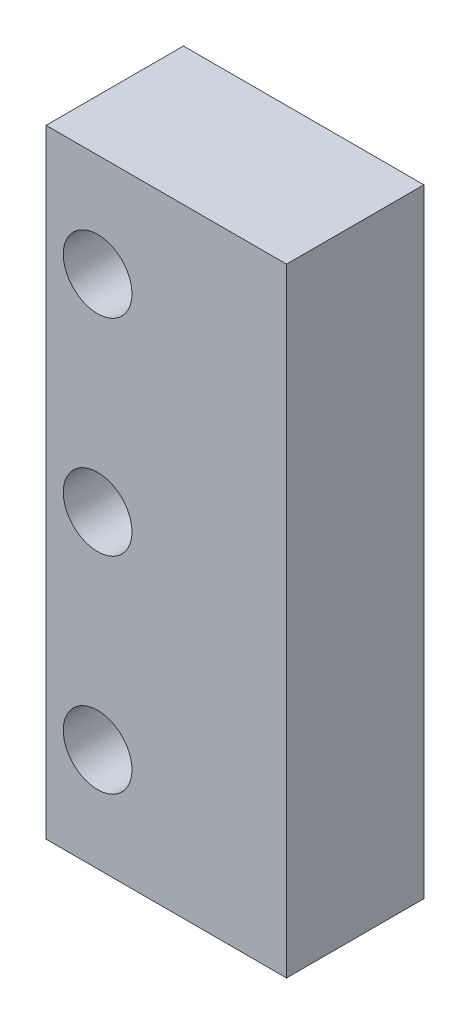
ISO-10303-21;
HEADER;
FILE_DESCRIPTION(('STEP AP214'),'2;1');
FILE_NAME('part.step','',(''),(''),'','','');
FILE_SCHEMA(('AUTOMOTIVE_DESIGN { 1 0 10303 214 1 1 1 1 }'));
ENDSEC;
DATA;
#1=APPLICATION_CONTEXT('core data for automotive mechanical design processes');
#2=APPLICATION_PROTOCOL_DEFINITION('international standard','automotive_design',2000,#1);
#3=PRODUCT_CONTEXT('',#1,'mechanical');
#4=PRODUCT('Part','Part','',(#3));
#5=PRODUCT_RELATED_PRODUCT_CATEGORY('part','',(#4));
#6=PRODUCT_DEFINITION_FORMATION('','',#4);
#7=PRODUCT_DEFINITION_CONTEXT('part definition',#1,'design');
#8=PRODUCT_DEFINITION('design','',#6,#7);
#9=PRODUCT_DEFINITION_SHAPE('','',#8);
#10=(LENGTH_UNIT() NAMED_UNIT(*) SI_UNIT(.MILLI.,.METRE.));
#11=(NAMED_UNIT(*) PLANE_ANGLE_UNIT() SI_UNIT($,.RADIAN.));
#12=(NAMED_UNIT(*) SI_UNIT($,.STERADIAN.) SOLID_ANGLE_UNIT());
#13=UNCERTAINTY_MEASURE_WITH_UNIT(LENGTH_MEASURE(1.E-05),#10,'distance_accuracy_value','');
#14=(GEOMETRIC_REPRESENTATION_CONTEXT(3) GLOBAL_UNCERTAINTY_ASSIGNED_CONTEXT((#13)) GLOBAL_UNIT_ASSIGNED_CONTEXT((#10,
#11,#12)) REPRESENTATION_CONTEXT('',''));
#15=CARTESIAN_POINT('',(0.,0.,0.));
#16=DIRECTION('',(0.,0.,1.));
#17=DIRECTION('',(1.,0.,0.));
#18=AXIS2_PLACEMENT_3D('',#15,#16,#17);
#19=CARTESIAN_POINT('',(0.,0.,-12.7));
#20=DIRECTION('',(1.,0.,0.));
#21=DIRECTION('',(0.,0.,-1.));
#22=AXIS2_PLACEMENT_3D('',#19,#20,#21);
#23=PLANE('',#22);
#24=DIRECTION('',(0.,1.,0.));
#25=VECTOR('',#24,1.);
#26=CARTESIAN_POINT('',(0.,0.,0.));
#27=LINE('',#26,#25);
#28=CARTESIAN_POINT('',(0.,0.,0.));
#29=VERTEX_POINT('',#28);
#30=CARTESIAN_POINT('',(0.,57.15,0.));
#31=VERTEX_POINT('',#30);
#32=EDGE_CURVE('E121',#29,#31,#27,.T.);
#33=ORIENTED_EDGE('',*,*,#32,.F.);
#34=DIRECTION('',(0.,0.,1.));
#35=VECTOR('',#34,1.);
#36=CARTESIAN_POINT('',(0.,0.,-12.7));
#37=LINE('',#36,#35);
#38=CARTESIAN_POINT('',(0.,0.,-12.7));
#39=VERTEX_POINT('',#38);
#40=EDGE_CURVE('E11',#39,#29,#37,.T.);
#41=ORIENTED_EDGE('',*,*,#40,.F.);
#42=DIRECTION('',(0.,1.,0.));
#43=VECTOR('',#42,1.);
#44=CARTESIAN_POINT('',(0.,0.,-12.7));
#45=LINE('',#44,#43);
#46=CARTESIAN_POINT('',(0.,57.15,-12.7));
#47=VERTEX_POINT('',#46);
#48=EDGE_CURVE('E112',#39,#47,#45,.T.);
#49=ORIENTED_EDGE('',*,*,#48,.T.);
#50=DIRECTION('',(0.,0.,1.));
#51=VECTOR('',#50,1.);
#52=CARTESIAN_POINT('',(0.,57.15,-12.7));
#53=LINE('',#52,#51);
#54=EDGE_CURVE('E50',#47,#31,#53,.T.);
#55=ORIENTED_EDGE('',*,*,#54,.T.);
#56=EDGE_LOOP('',(#33,#41,#49,#55));
#57=FACE_BOUND('',#56,.T.);
#58=ADVANCED_FACE('F47',(#57),#23,.T.);
#59=CARTESIAN_POINT('',(0.,0.,-12.7));
#60=DIRECTION('',(0.,-1.,0.));
#61=DIRECTION('',(1.,0.,0.));
#62=AXIS2_PLACEMENT_3D('',#59,#60,#61);
#63=PLANE('',#62);
#64=DIRECTION('',(1.,0.,0.));
#65=VECTOR('',#64,1.);
#66=CARTESIAN_POINT('',(0.,0.,0.));
#67=LINE('',#66,#65);
#68=CARTESIAN_POINT('',(-22.225,0.,0.));
#69=VERTEX_POINT('',#68);
#70=EDGE_CURVE('E116',#69,#29,#67,.T.);
#71=ORIENTED_EDGE('',*,*,#70,.F.);
#72=DIRECTION('',(0.,0.,1.));
#73=VECTOR('',#72,1.);
#74=CARTESIAN_POINT('',(-22.225,0.,-12.7));
#75=LINE('',#74,#73);
#76=CARTESIAN_POINT('',(-22.225,0.,-12.7));
#77=VERTEX_POINT('',#76);
#78=EDGE_CURVE('E56',#77,#69,#75,.T.);
#79=ORIENTED_EDGE('',*,*,#78,.F.);
#80=DIRECTION('',(1.,0.,0.));
#81=VECTOR('',#80,1.);
#82=CARTESIAN_POINT('',(0.,0.,-12.7));
#83=LINE('',#82,#81);
#84=EDGE_CURVE('E107',#77,#39,#83,.T.);
#85=ORIENTED_EDGE('',*,*,#84,.T.);
#86=ORIENTED_EDGE('',*,*,#40,.T.);
#87=EDGE_LOOP('',(#71,#79,#85,#86));
#88=FACE_BOUND('',#87,.T.);
#89=ADVANCED_FACE('F135',(#88),#63,.T.);
#90=CARTESIAN_POINT('',(-22.225,0.,-12.7));
#91=DIRECTION('',(-1.,0.,0.));
#92=DIRECTION('',(0.,0.,1.));
#93=AXIS2_PLACEMENT_3D('',#90,#91,#92);
#94=PLANE('',#93);
#95=DIRECTION('',(0.,-1.,0.));
#96=VECTOR('',#95,1.);
#97=CARTESIAN_POINT('',(-22.225,0.,0.));
#98=LINE('',#97,#96);
#99=CARTESIAN_POINT('',(-22.225,57.15,0.));
#100=VERTEX_POINT('',#99);
#101=EDGE_CURVE('E101',#100,#69,#98,.T.);
#102=ORIENTED_EDGE('',*,*,#101,.F.);
#103=DIRECTION('',(0.,0.,1.));
#104=VECTOR('',#103,1.);
#105=CARTESIAN_POINT('',(-22.225,57.15,-12.7));
#106=LINE('',#105,#104);
#107=CARTESIAN_POINT('',(-22.225,57.15,-12.7));
#108=VERTEX_POINT('',#107);
#109=EDGE_CURVE('E96',#108,#100,#106,.T.);
#110=ORIENTED_EDGE('',*,*,#109,.F.);
#111=DIRECTION('',(0.,-1.,0.));
#112=VECTOR('',#111,1.);
#113=CARTESIAN_POINT('',(-22.225,0.,-12.7));
#114=LINE('',#113,#112);
#115=EDGE_CURVE('E99',#108,#77,#114,.T.);
#116=ORIENTED_EDGE('',*,*,#115,.T.);
#117=ORIENTED_EDGE('',*,*,#78,.T.);
#118=EDGE_LOOP('',(#102,#110,#116,#117));
#119=FACE_BOUND('',#118,.T.);
#120=ADVANCED_FACE('F98',(#119),#94,.T.);
#121=CARTESIAN_POINT('',(0.,57.15,-12.7));
#122=DIRECTION('',(0.,1.,0.));
#123=DIRECTION('',(0.,0.,1.));
#124=AXIS2_PLACEMENT_3D('',#121,#122,#123);
#125=PLANE('',#124);
#126=DIRECTION('',(-1.,0.,0.));
#127=VECTOR('',#126,1.);
#128=CARTESIAN_POINT('',(0.,57.15,0.));
#129=LINE('',#128,#127);
#130=EDGE_CURVE('E125',#31,#100,#129,.T.);
#131=ORIENTED_EDGE('',*,*,#130,.F.);
#132=ORIENTED_EDGE('',*,*,#54,.F.);
#133=DIRECTION('',(-1.,0.,0.));
#134=VECTOR('',#133,1.);
#135=CARTESIAN_POINT('',(0.,57.15,-12.7));
#136=LINE('',#135,#134);
#137=EDGE_CURVE('E106',#47,#108,#136,.T.);
#138=ORIENTED_EDGE('',*,*,#137,.T.);
#139=ORIENTED_EDGE('',*,*,#109,.T.);
#140=EDGE_LOOP('',(#131,#132,#138,#139));
#141=FACE_BOUND('',#140,.T.);
#142=ADVANCED_FACE('F110',(#141),#125,.T.);
#143=CARTESIAN_POINT('',(0.,0.,-12.7));
#144=DIRECTION('',(0.,0.,1.));
#145=DIRECTION('',(1.,0.,0.));
#146=AXIS2_PLACEMENT_3D('',#143,#144,#145);
#147=PLANE('',#146);
#148=CARTESIAN_POINT('',(-17.4625,47.625,-12.7));
#149=DIRECTION('',(0.,0.,1.));
#150=DIRECTION('',(1.,0.,0.));
#151=AXIS2_PLACEMENT_3D('',#148,#149,#150);
#152=CIRCLE('',#151,3.175);
#153=CARTESIAN_POINT('',(-14.2875,47.625,-12.7));
#154=VERTEX_POINT('',#153);
#155=EDGE_CURVE('E170',#154,#154,#152,.T.);
#156=ORIENTED_EDGE('',*,*,#155,.T.);
#157=EDGE_LOOP('',(#156));
#158=FACE_BOUND('',#157,.T.);
#159=CARTESIAN_POINT('',(-17.4625,28.575,-12.7));
#160=DIRECTION('',(0.,0.,1.));
#161=DIRECTION('',(1.,0.,0.));
#162=AXIS2_PLACEMENT_3D('',#159,#160,#161);
#163=CIRCLE('',#162,3.175);
#164=CARTESIAN_POINT('',(-14.2875,28.575,-12.7));
#165=VERTEX_POINT('',#164);
#166=EDGE_CURVE('E183',#165,#165,#163,.T.);
#167=ORIENTED_EDGE('',*,*,#166,.T.);
#168=EDGE_LOOP('',(#167));
#169=FACE_BOUND('',#168,.T.);
#170=CARTESIAN_POINT('',(-17.4625,9.525,-12.7));
#171=DIRECTION('',(0.,0.,1.));
#172=DIRECTION('',(1.,0.,0.));
#173=AXIS2_PLACEMENT_3D('',#170,#171,#172);
#174=CIRCLE('',#173,3.175);
#175=CARTESIAN_POINT('',(-14.2875,9.525,-12.7));
#176=VERTEX_POINT('',#175);
#177=EDGE_CURVE('E126',#176,#176,#174,.T.);
#178=ORIENTED_EDGE('',*,*,#177,.T.);
#179=EDGE_LOOP('',(#178));
#180=FACE_BOUND('',#179,.T.);
#181=ORIENTED_EDGE('',*,*,#48,.F.);
#182=ORIENTED_EDGE('',*,*,#84,.F.);
#183=ORIENTED_EDGE('',*,*,#115,.F.);
#184=ORIENTED_EDGE('',*,*,#137,.F.);
#185=EDGE_LOOP('',(#181,#182,#183,#184));
#186=FACE_BOUND('',#185,.T.);
#187=ADVANCED_FACE('F105',(#158,#169,#180,#186),#147,.F.);
#188=CARTESIAN_POINT('',(0.,0.,0.));
#189=DIRECTION('',(0.,0.,1.));
#190=DIRECTION('',(1.,0.,0.));
#191=AXIS2_PLACEMENT_3D('',#188,#189,#190);
#192=PLANE('',#191);
#193=CARTESIAN_POINT('',(-17.4625,47.625,0.));
#194=DIRECTION('',(0.,0.,1.));
#195=DIRECTION('',(1.,0.,0.));
#196=AXIS2_PLACEMENT_3D('',#193,#194,#195);
#197=CIRCLE('',#196,3.175);
#198=CARTESIAN_POINT('',(-14.2875,47.625,0.));
#199=VERTEX_POINT('',#198);
#200=EDGE_CURVE('E173',#199,#199,#197,.T.);
#201=ORIENTED_EDGE('',*,*,#200,.F.);
#202=EDGE_LOOP('',(#201));
#203=FACE_BOUND('',#202,.T.);
#204=CARTESIAN_POINT('',(-17.4625,28.575,0.));
#205=DIRECTION('',(0.,0.,1.));
#206=DIRECTION('',(1.,0.,0.));
#207=AXIS2_PLACEMENT_3D('',#204,#205,#206);
#208=CIRCLE('',#207,3.175);
#209=CARTESIAN_POINT('',(-14.2875,28.575,0.));
#210=VERTEX_POINT('',#209);
#211=EDGE_CURVE('E177',#210,#210,#208,.T.);
#212=ORIENTED_EDGE('',*,*,#211,.F.);
#213=EDGE_LOOP('',(#212));
#214=FACE_BOUND('',#213,.T.);
#215=CARTESIAN_POINT('',(-17.4625,9.525,0.));
#216=DIRECTION('',(0.,0.,1.));
#217=DIRECTION('',(1.,0.,0.));
#218=AXIS2_PLACEMENT_3D('',#215,#216,#217);
#219=CIRCLE('',#218,3.175);
#220=CARTESIAN_POINT('',(-14.2875,9.525,0.));
#221=VERTEX_POINT('',#220);
#222=EDGE_CURVE('E187',#221,#221,#219,.T.);
#223=ORIENTED_EDGE('',*,*,#222,.F.);
#224=EDGE_LOOP('',(#223));
#225=FACE_BOUND('',#224,.T.);
#226=ORIENTED_EDGE('',*,*,#32,.T.);
#227=ORIENTED_EDGE('',*,*,#130,.T.);
#228=ORIENTED_EDGE('',*,*,#101,.T.);
#229=ORIENTED_EDGE('',*,*,#70,.T.);
#230=EDGE_LOOP('',(#226,#227,#228,#229));
#231=FACE_BOUND('',#230,.T.);
#232=ADVANCED_FACE('F134',(#203,#214,#225,#231),#192,.T.);
#233=CARTESIAN_POINT('',(-17.4625,9.525,0.));
#234=DIRECTION('',(0.,0.,1.));
#235=DIRECTION('',(1.,0.,0.));
#236=AXIS2_PLACEMENT_3D('',#233,#234,#235);
#237=CYLINDRICAL_SURFACE('',#236,3.175);
#238=ORIENTED_EDGE('',*,*,#177,.F.);
#239=EDGE_LOOP('',(#238));
#240=FACE_BOUND('',#239,.T.);
#241=ORIENTED_EDGE('',*,*,#222,.T.);
#242=EDGE_LOOP('',(#241));
#243=FACE_BOUND('',#242,.T.);
#244=ADVANCED_FACE('F151',(#240,#243),#237,.F.);
#245=CARTESIAN_POINT('',(-17.4625,28.575,0.));
#246=DIRECTION('',(0.,0.,1.));
#247=DIRECTION('',(1.,0.,0.));
#248=AXIS2_PLACEMENT_3D('',#245,#246,#247);
#249=CYLINDRICAL_SURFACE('',#248,3.175);
#250=ORIENTED_EDGE('',*,*,#166,.F.);
#251=EDGE_LOOP('',(#250));
#252=FACE_BOUND('',#251,.T.);
#253=ORIENTED_EDGE('',*,*,#211,.T.);
#254=EDGE_LOOP('',(#253));
#255=FACE_BOUND('',#254,.T.);
#256=ADVANCED_FACE('F158',(#252,#255),#249,.F.);
#257=CARTESIAN_POINT('',(-17.4625,47.625,0.));
#258=DIRECTION('',(0.,0.,1.));
#259=DIRECTION('',(1.,0.,0.));
#260=AXIS2_PLACEMENT_3D('',#257,#258,#259);
#261=CYLINDRICAL_SURFACE('',#260,3.175);
#262=ORIENTED_EDGE('',*,*,#155,.F.);
#263=EDGE_LOOP('',(#262));
#264=FACE_BOUND('',#263,.T.);
#265=ORIENTED_EDGE('',*,*,#200,.T.);
#266=EDGE_LOOP('',(#265));
#267=FACE_BOUND('',#266,.T.);
#268=ADVANCED_FACE('F162',(#264,#267),#261,.F.);
#269=CLOSED_SHELL('',(#58,#89,#120,#142,#187,#232,#244,#256,#268));
#270=MANIFOLD_SOLID_BREP('B2',#269);
#271=ADVANCED_BREP_SHAPE_REPRESENTATION('',(#18,#270),#14);
#272=SHAPE_DEFINITION_REPRESENTATION(#9,#271);
ENDSEC;
END-ISO-10303-21;
